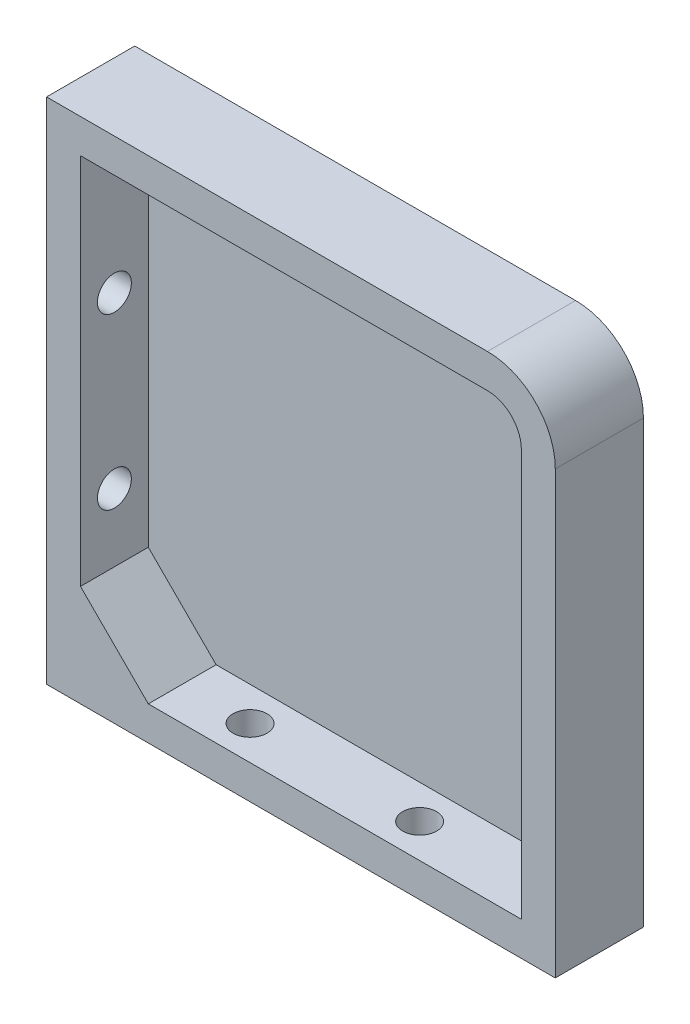
ISO-10303-21;
HEADER;
FILE_DESCRIPTION(('STEP AP214'),'2;1');
FILE_NAME('part.step','',(''),(''),'','','');
FILE_SCHEMA(('AUTOMOTIVE_DESIGN { 1 0 10303 214 1 1 1 1 }'));
ENDSEC;
DATA;
#1=APPLICATION_CONTEXT('core data for automotive mechanical design processes');
#2=APPLICATION_PROTOCOL_DEFINITION('international standard','automotive_design',2000,#1);
#3=PRODUCT_CONTEXT('',#1,'mechanical');
#4=PRODUCT('Part','Part','',(#3));
#5=PRODUCT_RELATED_PRODUCT_CATEGORY('part','',(#4));
#6=PRODUCT_DEFINITION_FORMATION('','',#4);
#7=PRODUCT_DEFINITION_CONTEXT('part definition',#1,'design');
#8=PRODUCT_DEFINITION('design','',#6,#7);
#9=PRODUCT_DEFINITION_SHAPE('','',#8);
#10=(LENGTH_UNIT() NAMED_UNIT(*) SI_UNIT(.MILLI.,.METRE.));
#11=(NAMED_UNIT(*) PLANE_ANGLE_UNIT() SI_UNIT($,.RADIAN.));
#12=(NAMED_UNIT(*) SI_UNIT($,.STERADIAN.) SOLID_ANGLE_UNIT());
#13=UNCERTAINTY_MEASURE_WITH_UNIT(LENGTH_MEASURE(1.E-05),#10,'distance_accuracy_value','');
#14=(GEOMETRIC_REPRESENTATION_CONTEXT(3) GLOBAL_UNCERTAINTY_ASSIGNED_CONTEXT((#13)) GLOBAL_UNIT_ASSIGNED_CONTEXT((#10,
#11,#12)) REPRESENTATION_CONTEXT('',''));
#15=CARTESIAN_POINT('',(0.,0.,0.));
#16=DIRECTION('',(0.,0.,1.));
#17=DIRECTION('',(1.,0.,0.));
#18=AXIS2_PLACEMENT_3D('',#15,#16,#17);
#19=CARTESIAN_POINT('',(-15.8815636921236,33.7284482758621,13.));
#20=DIRECTION('',(1.,0.,0.));
#21=DIRECTION('',(0.,1.,0.));
#22=AXIS2_PLACEMENT_3D('',#19,#20,#21);
#23=PLANE('',#22);
#24=CARTESIAN_POINT('',(-15.8815636921236,8.72844827586207,8.));
#25=DIRECTION('',(1.,0.,0.));
#26=DIRECTION('',(0.,1.,0.));
#27=AXIS2_PLACEMENT_3D('',#24,#25,#26);
#28=CIRCLE('',#27,2.5);
#29=CARTESIAN_POINT('',(-15.8815636921236,11.2284482758621,8.));
#30=VERTEX_POINT('',#29);
#31=EDGE_CURVE('E151',#30,#30,#28,.F.);
#32=ORIENTED_EDGE('',*,*,#31,.T.);
#33=EDGE_LOOP('',(#32));
#34=FACE_BOUND('',#33,.T.);
#35=CARTESIAN_POINT('',(-15.8815636921236,-16.2715517241379,8.));
#36=DIRECTION('',(1.,0.,0.));
#37=DIRECTION('',(0.,1.,0.));
#38=AXIS2_PLACEMENT_3D('',#35,#36,#37);
#39=CIRCLE('',#38,2.5);
#40=CARTESIAN_POINT('',(-15.8815636921236,-13.7715517241379,8.));
#41=VERTEX_POINT('',#40);
#42=EDGE_CURVE('E126',#41,#41,#39,.F.);
#43=ORIENTED_EDGE('',*,*,#42,.T.);
#44=EDGE_LOOP('',(#43));
#45=FACE_BOUND('',#44,.T.);
#46=DIRECTION('',(0.,-1.,0.));
#47=VECTOR('',#46,1.);
#48=CARTESIAN_POINT('',(-15.8815636921236,23.7284482758621,13.));
#49=LINE('',#48,#47);
#50=CARTESIAN_POINT('',(-15.8815636921236,28.7284482758621,13.));
#51=VERTEX_POINT('',#50);
#52=CARTESIAN_POINT('',(-15.8815636921236,-26.2715517241379,13.));
#53=VERTEX_POINT('',#52);
#54=EDGE_CURVE('E48',#51,#53,#49,.T.);
#55=ORIENTED_EDGE('',*,*,#54,.T.);
#56=DIRECTION('',(0.,0.,-1.));
#57=VECTOR('',#56,1.);
#58=CARTESIAN_POINT('',(-15.8815636921236,-26.2715517241379,27.142135623731));
#59=LINE('',#58,#57);
#60=CARTESIAN_POINT('',(-15.8815636921236,-26.2715517241379,3.));
#61=VERTEX_POINT('',#60);
#62=EDGE_CURVE('E129',#53,#61,#59,.T.);
#63=ORIENTED_EDGE('',*,*,#62,.T.);
#64=DIRECTION('',(0.,-1.,0.));
#65=VECTOR('',#64,1.);
#66=CARTESIAN_POINT('',(-15.8815636921236,23.7284482758621,3.));
#67=LINE('',#66,#65);
#68=CARTESIAN_POINT('',(-15.8815636921236,28.7284482758621,3.));
#69=VERTEX_POINT('',#68);
#70=EDGE_CURVE('E118',#69,#61,#67,.T.);
#71=ORIENTED_EDGE('',*,*,#70,.F.);
#72=DIRECTION('',(0.,0.,-1.));
#73=VECTOR('',#72,1.);
#74=CARTESIAN_POINT('',(-15.8815636921236,28.7284482758621,13.));
#75=LINE('',#74,#73);
#76=EDGE_CURVE('E162',#51,#69,#75,.T.);
#77=ORIENTED_EDGE('',*,*,#76,.F.);
#78=EDGE_LOOP('',(#55,#63,#71,#77));
#79=FACE_BOUND('',#78,.T.);
#80=ADVANCED_FACE('F33',(#34,#45,#79),#23,.T.);
#81=CARTESIAN_POINT('',(-20.8815636921236,-36.2715517241379,13.));
#82=DIRECTION('',(0.,1.,0.));
#83=DIRECTION('',(0.,0.,1.));
#84=AXIS2_PLACEMENT_3D('',#81,#82,#83);
#85=PLANE('',#84);
#86=CARTESIAN_POINT('',(29.1184363078764,-36.2715517241379,8.));
#87=DIRECTION('',(0.,1.,0.));
#88=DIRECTION('',(0.,0.,1.));
#89=AXIS2_PLACEMENT_3D('',#86,#87,#88);
#90=CIRCLE('',#89,2.5);
#91=CARTESIAN_POINT('',(29.1184363078764,-36.2715517241379,5.5));
#92=VERTEX_POINT('',#91);
#93=EDGE_CURVE('E142',#92,#92,#90,.F.);
#94=ORIENTED_EDGE('',*,*,#93,.T.);
#95=EDGE_LOOP('',(#94));
#96=FACE_BOUND('',#95,.T.);
#97=CARTESIAN_POINT('',(4.11843630787644,-36.2715517241379,8.));
#98=DIRECTION('',(0.,1.,0.));
#99=DIRECTION('',(0.,0.,1.));
#100=AXIS2_PLACEMENT_3D('',#97,#98,#99);
#101=CIRCLE('',#100,2.5);
#102=CARTESIAN_POINT('',(4.11843630787644,-36.2715517241379,5.5));
#103=VERTEX_POINT('',#102);
#104=EDGE_CURVE('E148',#103,#103,#101,.F.);
#105=ORIENTED_EDGE('',*,*,#104,.T.);
#106=EDGE_LOOP('',(#105));
#107=FACE_BOUND('',#106,.T.);
#108=DIRECTION('',(1.,0.,0.));
#109=VECTOR('',#108,1.);
#110=CARTESIAN_POINT('',(44.1184363078764,-36.2715517241379,3.));
#111=LINE('',#110,#109);
#112=CARTESIAN_POINT('',(-5.88156369212357,-36.2715517241379,3.));
#113=VERTEX_POINT('',#112);
#114=CARTESIAN_POINT('',(49.1184363078764,-36.2715517241379,3.));
#115=VERTEX_POINT('',#114);
#116=EDGE_CURVE('E125',#113,#115,#111,.T.);
#117=ORIENTED_EDGE('',*,*,#116,.F.);
#118=DIRECTION('',(0.,0.,-1.));
#119=VECTOR('',#118,1.);
#120=CARTESIAN_POINT('',(-5.88156369212357,-36.2715517241379,27.142135623731));
#121=LINE('',#120,#119);
#122=CARTESIAN_POINT('',(-5.88156369212357,-36.2715517241379,13.));
#123=VERTEX_POINT('',#122);
#124=EDGE_CURVE('E56',#123,#113,#121,.T.);
#125=ORIENTED_EDGE('',*,*,#124,.F.);
#126=DIRECTION('',(1.,0.,0.));
#127=VECTOR('',#126,1.);
#128=CARTESIAN_POINT('',(44.1184363078764,-36.2715517241379,13.));
#129=LINE('',#128,#127);
#130=CARTESIAN_POINT('',(49.1184363078764,-36.2715517241379,13.));
#131=VERTEX_POINT('',#130);
#132=EDGE_CURVE('E182',#123,#131,#129,.T.);
#133=ORIENTED_EDGE('',*,*,#132,.T.);
#134=DIRECTION('',(0.,0.,-1.));
#135=VECTOR('',#134,1.);
#136=CARTESIAN_POINT('',(49.1184363078764,-36.2715517241379,13.));
#137=LINE('',#136,#135);
#138=EDGE_CURVE('E168',#131,#115,#137,.T.);
#139=ORIENTED_EDGE('',*,*,#138,.T.);
#140=EDGE_LOOP('',(#117,#125,#133,#139));
#141=FACE_BOUND('',#140,.T.);
#142=ADVANCED_FACE('F258',(#96,#107,#141),#85,.T.);
#143=CARTESIAN_POINT('',(44.1184363078764,23.7284482758621,3.));
#144=DIRECTION('',(0.,0.,-1.));
#145=DIRECTION('',(-1.,0.,0.));
#146=AXIS2_PLACEMENT_3D('',#143,#144,#145);
#147=PLANE('',#146);
#148=DIRECTION('',(-0.707106781186547,0.707106781186548,0.));
#149=VECTOR('',#148,1.);
#150=CARTESIAN_POINT('',(-15.8815636921236,-26.2715517241379,3.));
#151=LINE('',#150,#149);
#152=EDGE_CURVE('E121',#113,#61,#151,.T.);
#153=ORIENTED_EDGE('',*,*,#152,.F.);
#154=ORIENTED_EDGE('',*,*,#116,.T.);
#155=DIRECTION('',(0.,1.,0.));
#156=VECTOR('',#155,1.);
#157=CARTESIAN_POINT('',(49.1184363078764,23.7284482758621,3.));
#158=LINE('',#157,#156);
#159=CARTESIAN_POINT('',(49.1184363078764,23.728448275862,3.));
#160=VERTEX_POINT('',#159);
#161=EDGE_CURVE('E167',#115,#160,#158,.T.);
#162=ORIENTED_EDGE('',*,*,#161,.T.);
#163=CARTESIAN_POINT('',(44.1184363078764,23.7284482758621,3.));
#164=DIRECTION('',(0.,0.,-1.));
#165=DIRECTION('',(-1.,0.,0.));
#166=AXIS2_PLACEMENT_3D('',#163,#164,#165);
#167=CIRCLE('',#166,5.);
#168=CARTESIAN_POINT('',(44.1184363078763,28.7284482758621,3.));
#169=VERTEX_POINT('',#168);
#170=EDGE_CURVE('E174',#160,#169,#167,.F.);
#171=ORIENTED_EDGE('',*,*,#170,.T.);
#172=DIRECTION('',(-1.,0.,0.));
#173=VECTOR('',#172,1.);
#174=CARTESIAN_POINT('',(44.1184363078764,28.7284482758621,3.));
#175=LINE('',#174,#173);
#176=EDGE_CURVE('E123',#169,#69,#175,.T.);
#177=ORIENTED_EDGE('',*,*,#176,.T.);
#178=ORIENTED_EDGE('',*,*,#70,.T.);
#179=EDGE_LOOP('',(#153,#154,#162,#171,#177,#178));
#180=FACE_BOUND('',#179,.T.);
#181=ADVANCED_FACE('F119',(#180),#147,.F.);
#182=CARTESIAN_POINT('',(44.1184363078764,23.7284482758621,13.));
#183=DIRECTION('',(0.,0.,-1.));
#184=DIRECTION('',(-1.,0.,0.));
#185=AXIS2_PLACEMENT_3D('',#182,#183,#184);
#186=PLANE('',#185);
#187=DIRECTION('',(0.707106781186547,-0.707106781186548,0.));
#188=VECTOR('',#187,1.);
#189=CARTESIAN_POINT('',(-15.8815636921236,-26.2715517241379,13.));
#190=LINE('',#189,#188);
#191=EDGE_CURVE('E137',#53,#123,#190,.T.);
#192=ORIENTED_EDGE('',*,*,#191,.F.);
#193=ORIENTED_EDGE('',*,*,#54,.F.);
#194=DIRECTION('',(-1.,0.,0.));
#195=VECTOR('',#194,1.);
#196=CARTESIAN_POINT('',(44.1184363078764,28.7284482758621,13.));
#197=LINE('',#196,#195);
#198=CARTESIAN_POINT('',(44.1184363078764,28.7284482758621,13.));
#199=VERTEX_POINT('',#198);
#200=EDGE_CURVE('E165',#199,#51,#197,.T.);
#201=ORIENTED_EDGE('',*,*,#200,.F.);
#202=CARTESIAN_POINT('',(44.1184363078764,23.7284482758621,13.));
#203=DIRECTION('',(0.,0.,-1.));
#204=DIRECTION('',(-1.,0.,0.));
#205=AXIS2_PLACEMENT_3D('',#202,#203,#204);
#206=CIRCLE('',#205,5.);
#207=CARTESIAN_POINT('',(49.1184363078764,23.728448275862,13.));
#208=VERTEX_POINT('',#207);
#209=EDGE_CURVE('E186',#208,#199,#206,.F.);
#210=ORIENTED_EDGE('',*,*,#209,.F.);
#211=DIRECTION('',(0.,1.,0.));
#212=VECTOR('',#211,1.);
#213=CARTESIAN_POINT('',(49.1184363078764,23.7284482758621,13.));
#214=LINE('',#213,#212);
#215=EDGE_CURVE('E184',#131,#208,#214,.T.);
#216=ORIENTED_EDGE('',*,*,#215,.F.);
#217=ORIENTED_EDGE('',*,*,#132,.F.);
#218=EDGE_LOOP('',(#192,#193,#201,#210,#216,#217));
#219=FACE_BOUND('',#218,.T.);
#220=DIRECTION('',(0.,-1.,0.));
#221=VECTOR('',#220,1.);
#222=CARTESIAN_POINT('',(-20.8815636921236,33.7284482758621,13.));
#223=LINE('',#222,#221);
#224=CARTESIAN_POINT('',(-20.8815636921236,33.7284482758621,13.));
#225=VERTEX_POINT('',#224);
#226=CARTESIAN_POINT('',(-20.8815636921236,-41.2715517241379,13.));
#227=VERTEX_POINT('',#226);
#228=EDGE_CURVE('E190',#225,#227,#223,.T.);
#229=ORIENTED_EDGE('',*,*,#228,.T.);
#230=DIRECTION('',(1.,0.,0.));
#231=VECTOR('',#230,1.);
#232=CARTESIAN_POINT('',(-20.8815636921236,-41.2715517241379,13.));
#233=LINE('',#232,#231);
#234=CARTESIAN_POINT('',(54.1184363078764,-41.2715517241379,13.));
#235=VERTEX_POINT('',#234);
#236=EDGE_CURVE('E193',#227,#235,#233,.T.);
#237=ORIENTED_EDGE('',*,*,#236,.T.);
#238=DIRECTION('',(0.,1.,0.));
#239=VECTOR('',#238,1.);
#240=CARTESIAN_POINT('',(54.1184363078764,23.728448275862,13.));
#241=LINE('',#240,#239);
#242=CARTESIAN_POINT('',(54.1184363078764,23.728448275862,13.));
#243=VERTEX_POINT('',#242);
#244=EDGE_CURVE('E196',#235,#243,#241,.T.);
#245=ORIENTED_EDGE('',*,*,#244,.T.);
#246=CARTESIAN_POINT('',(44.1184363078764,23.7284482758621,13.));
#247=DIRECTION('',(0.,0.,1.));
#248=DIRECTION('',(-1.,0.,0.));
#249=AXIS2_PLACEMENT_3D('',#246,#247,#248);
#250=CIRCLE('',#249,10.);
#251=CARTESIAN_POINT('',(44.1184363078764,33.7284482758621,13.));
#252=VERTEX_POINT('',#251);
#253=EDGE_CURVE('E198',#243,#252,#250,.T.);
#254=ORIENTED_EDGE('',*,*,#253,.T.);
#255=DIRECTION('',(-1.,0.,0.));
#256=VECTOR('',#255,1.);
#257=CARTESIAN_POINT('',(-20.8815636921236,33.7284482758621,13.));
#258=LINE('',#257,#256);
#259=EDGE_CURVE('E200',#252,#225,#258,.T.);
#260=ORIENTED_EDGE('',*,*,#259,.T.);
#261=EDGE_LOOP('',(#229,#237,#245,#254,#260));
#262=FACE_BOUND('',#261,.T.);
#263=ADVANCED_FACE('F242',(#219,#262),#186,.F.);
#264=CARTESIAN_POINT('',(-20.8815636921236,33.7284482758621,13.));
#265=DIRECTION('',(1.,0.,0.));
#266=DIRECTION('',(0.,1.,0.));
#267=AXIS2_PLACEMENT_3D('',#264,#265,#266);
#268=PLANE('',#267);
#269=CARTESIAN_POINT('',(-20.8815636921236,8.72844827586207,8.));
#270=DIRECTION('',(-1.,0.,0.));
#271=DIRECTION('',(0.,-1.,0.));
#272=AXIS2_PLACEMENT_3D('',#269,#270,#271);
#273=CIRCLE('',#272,2.5);
#274=CARTESIAN_POINT('',(-20.8815636921236,6.22844827586207,8.));
#275=VERTEX_POINT('',#274);
#276=EDGE_CURVE('E154',#275,#275,#273,.T.);
#277=ORIENTED_EDGE('',*,*,#276,.F.);
#278=EDGE_LOOP('',(#277));
#279=FACE_BOUND('',#278,.T.);
#280=CARTESIAN_POINT('',(-20.8815636921236,-16.2715517241379,8.));
#281=DIRECTION('',(-1.,0.,0.));
#282=DIRECTION('',(0.,-1.,0.));
#283=AXIS2_PLACEMENT_3D('',#280,#281,#282);
#284=CIRCLE('',#283,2.5);
#285=CARTESIAN_POINT('',(-20.8815636921236,-18.7715517241379,8.));
#286=VERTEX_POINT('',#285);
#287=EDGE_CURVE('E157',#286,#286,#284,.T.);
#288=ORIENTED_EDGE('',*,*,#287,.F.);
#289=EDGE_LOOP('',(#288));
#290=FACE_BOUND('',#289,.T.);
#291=DIRECTION('',(0.,-1.,0.));
#292=VECTOR('',#291,1.);
#293=CARTESIAN_POINT('',(-20.8815636921236,33.7284482758621,0.));
#294=LINE('',#293,#292);
#295=CARTESIAN_POINT('',(-20.8815636921236,33.7284482758621,0.));
#296=VERTEX_POINT('',#295);
#297=CARTESIAN_POINT('',(-20.8815636921236,-41.2715517241379,0.));
#298=VERTEX_POINT('',#297);
#299=EDGE_CURVE('E171',#296,#298,#294,.T.);
#300=ORIENTED_EDGE('',*,*,#299,.T.);
#301=DIRECTION('',(0.,0.,-1.));
#302=VECTOR('',#301,1.);
#303=CARTESIAN_POINT('',(-20.8815636921236,-41.2715517241379,13.));
#304=LINE('',#303,#302);
#305=EDGE_CURVE('E11',#227,#298,#304,.T.);
#306=ORIENTED_EDGE('',*,*,#305,.F.);
#307=ORIENTED_EDGE('',*,*,#228,.F.);
#308=DIRECTION('',(0.,0.,-1.));
#309=VECTOR('',#308,1.);
#310=CARTESIAN_POINT('',(-20.8815636921236,33.7284482758621,13.));
#311=LINE('',#310,#309);
#312=EDGE_CURVE('E202',#225,#296,#311,.T.);
#313=ORIENTED_EDGE('',*,*,#312,.T.);
#314=EDGE_LOOP('',(#300,#306,#307,#313));
#315=FACE_BOUND('',#314,.T.);
#316=ADVANCED_FACE('F35',(#279,#290,#315),#268,.F.);
#317=CARTESIAN_POINT('',(-20.8815636921236,-41.2715517241379,13.));
#318=DIRECTION('',(0.,1.,0.));
#319=DIRECTION('',(0.,0.,1.));
#320=AXIS2_PLACEMENT_3D('',#317,#318,#319);
#321=PLANE('',#320);
#322=CARTESIAN_POINT('',(29.1184363078764,-41.2715517241379,8.));
#323=DIRECTION('',(0.,-1.,0.));
#324=DIRECTION('',(0.,0.,-1.));
#325=AXIS2_PLACEMENT_3D('',#322,#323,#324);
#326=CIRCLE('',#325,2.5);
#327=CARTESIAN_POINT('',(29.1184363078764,-41.2715517241379,5.5));
#328=VERTEX_POINT('',#327);
#329=EDGE_CURVE('E139',#328,#328,#326,.T.);
#330=ORIENTED_EDGE('',*,*,#329,.F.);
#331=EDGE_LOOP('',(#330));
#332=FACE_BOUND('',#331,.T.);
#333=CARTESIAN_POINT('',(4.11843630787644,-41.2715517241379,8.));
#334=DIRECTION('',(0.,-1.,0.));
#335=DIRECTION('',(0.,0.,-1.));
#336=AXIS2_PLACEMENT_3D('',#333,#334,#335);
#337=CIRCLE('',#336,2.5);
#338=CARTESIAN_POINT('',(4.11843630787644,-41.2715517241379,5.5));
#339=VERTEX_POINT('',#338);
#340=EDGE_CURVE('E145',#339,#339,#337,.T.);
#341=ORIENTED_EDGE('',*,*,#340,.F.);
#342=EDGE_LOOP('',(#341));
#343=FACE_BOUND('',#342,.T.);
#344=DIRECTION('',(1.,0.,0.));
#345=VECTOR('',#344,1.);
#346=CARTESIAN_POINT('',(-20.8815636921236,-41.2715517241379,0.));
#347=LINE('',#346,#345);
#348=CARTESIAN_POINT('',(54.1184363078764,-41.2715517241379,0.));
#349=VERTEX_POINT('',#348);
#350=EDGE_CURVE('E205',#298,#349,#347,.T.);
#351=ORIENTED_EDGE('',*,*,#350,.T.);
#352=DIRECTION('',(0.,0.,-1.));
#353=VECTOR('',#352,1.);
#354=CARTESIAN_POINT('',(54.1184363078764,-41.2715517241379,13.));
#355=LINE('',#354,#353);
#356=EDGE_CURVE('E41',#235,#349,#355,.T.);
#357=ORIENTED_EDGE('',*,*,#356,.F.);
#358=ORIENTED_EDGE('',*,*,#236,.F.);
#359=ORIENTED_EDGE('',*,*,#305,.T.);
#360=EDGE_LOOP('',(#351,#357,#358,#359));
#361=FACE_BOUND('',#360,.T.);
#362=ADVANCED_FACE('F244',(#332,#343,#361),#321,.F.);
#363=CARTESIAN_POINT('',(54.1184363078764,23.728448275862,13.));
#364=DIRECTION('',(-1.,0.,0.));
#365=DIRECTION('',(0.,0.,1.));
#366=AXIS2_PLACEMENT_3D('',#363,#364,#365);
#367=PLANE('',#366);
#368=DIRECTION('',(0.,1.,0.));
#369=VECTOR('',#368,1.);
#370=CARTESIAN_POINT('',(54.1184363078764,23.728448275862,0.));
#371=LINE('',#370,#369);
#372=CARTESIAN_POINT('',(54.1184363078764,23.728448275862,0.));
#373=VERTEX_POINT('',#372);
#374=EDGE_CURVE('E207',#349,#373,#371,.T.);
#375=ORIENTED_EDGE('',*,*,#374,.T.);
#376=DIRECTION('',(0.,0.,-1.));
#377=VECTOR('',#376,1.);
#378=CARTESIAN_POINT('',(54.1184363078764,23.728448275862,13.));
#379=LINE('',#378,#377);
#380=EDGE_CURVE('E217',#243,#373,#379,.T.);
#381=ORIENTED_EDGE('',*,*,#380,.F.);
#382=ORIENTED_EDGE('',*,*,#244,.F.);
#383=ORIENTED_EDGE('',*,*,#356,.T.);
#384=EDGE_LOOP('',(#375,#381,#382,#383));
#385=FACE_BOUND('',#384,.T.);
#386=ADVANCED_FACE('F224',(#385),#367,.F.);
#387=CARTESIAN_POINT('',(44.1184363078764,23.7284482758621,13.));
#388=DIRECTION('',(0.,0.,-1.));
#389=DIRECTION('',(-1.,0.,0.));
#390=AXIS2_PLACEMENT_3D('',#387,#388,#389);
#391=CYLINDRICAL_SURFACE('',#390,10.);
#392=CARTESIAN_POINT('',(44.1184363078764,23.7284482758621,0.));
#393=DIRECTION('',(0.,0.,1.));
#394=DIRECTION('',(-1.,0.,0.));
#395=AXIS2_PLACEMENT_3D('',#392,#393,#394);
#396=CIRCLE('',#395,10.);
#397=CARTESIAN_POINT('',(44.1184363078764,33.7284482758621,0.));
#398=VERTEX_POINT('',#397);
#399=EDGE_CURVE('E209',#373,#398,#396,.T.);
#400=ORIENTED_EDGE('',*,*,#399,.T.);
#401=DIRECTION('',(0.,0.,-1.));
#402=VECTOR('',#401,1.);
#403=CARTESIAN_POINT('',(44.1184363078764,33.7284482758621,13.));
#404=LINE('',#403,#402);
#405=EDGE_CURVE('E214',#252,#398,#404,.T.);
#406=ORIENTED_EDGE('',*,*,#405,.F.);
#407=ORIENTED_EDGE('',*,*,#253,.F.);
#408=ORIENTED_EDGE('',*,*,#380,.T.);
#409=EDGE_LOOP('',(#400,#406,#407,#408));
#410=FACE_BOUND('',#409,.T.);
#411=ADVANCED_FACE('F234',(#410),#391,.T.);
#412=CARTESIAN_POINT('',(-20.8815636921236,33.7284482758621,13.));
#413=DIRECTION('',(0.,-1.,0.));
#414=DIRECTION('',(0.,0.,-1.));
#415=AXIS2_PLACEMENT_3D('',#412,#413,#414);
#416=PLANE('',#415);
#417=DIRECTION('',(-1.,0.,0.));
#418=VECTOR('',#417,1.);
#419=CARTESIAN_POINT('',(-20.8815636921236,33.7284482758621,0.));
#420=LINE('',#419,#418);
#421=EDGE_CURVE('E194',#398,#296,#420,.T.);
#422=ORIENTED_EDGE('',*,*,#421,.T.);
#423=ORIENTED_EDGE('',*,*,#312,.F.);
#424=ORIENTED_EDGE('',*,*,#259,.F.);
#425=ORIENTED_EDGE('',*,*,#405,.T.);
#426=EDGE_LOOP('',(#422,#423,#424,#425));
#427=FACE_BOUND('',#426,.T.);
#428=ADVANCED_FACE('F238',(#427),#416,.F.);
#429=CARTESIAN_POINT('',(44.1184363078764,23.7284482758621,0.));
#430=DIRECTION('',(0.,0.,-1.));
#431=DIRECTION('',(-1.,0.,0.));
#432=AXIS2_PLACEMENT_3D('',#429,#430,#431);
#433=PLANE('',#432);
#434=ORIENTED_EDGE('',*,*,#299,.F.);
#435=ORIENTED_EDGE('',*,*,#421,.F.);
#436=ORIENTED_EDGE('',*,*,#399,.F.);
#437=ORIENTED_EDGE('',*,*,#374,.F.);
#438=ORIENTED_EDGE('',*,*,#350,.F.);
#439=EDGE_LOOP('',(#434,#435,#436,#437,#438));
#440=FACE_BOUND('',#439,.T.);
#441=ADVANCED_FACE('F230',(#440),#433,.T.);
#442=CARTESIAN_POINT('',(49.1184363078764,23.728448275862,13.));
#443=DIRECTION('',(-1.,0.,0.));
#444=DIRECTION('',(0.,0.,1.));
#445=AXIS2_PLACEMENT_3D('',#442,#443,#444);
#446=PLANE('',#445);
#447=ORIENTED_EDGE('',*,*,#161,.F.);
#448=ORIENTED_EDGE('',*,*,#138,.F.);
#449=ORIENTED_EDGE('',*,*,#215,.T.);
#450=DIRECTION('',(0.,0.,-1.));
#451=VECTOR('',#450,1.);
#452=CARTESIAN_POINT('',(49.1184363078764,23.728448275862,13.));
#453=LINE('',#452,#451);
#454=EDGE_CURVE('E172',#208,#160,#453,.T.);
#455=ORIENTED_EDGE('',*,*,#454,.T.);
#456=EDGE_LOOP('',(#447,#448,#449,#455));
#457=FACE_BOUND('',#456,.T.);
#458=ADVANCED_FACE('F271',(#457),#446,.T.);
#459=CARTESIAN_POINT('',(44.1184363078764,23.7284482758621,13.));
#460=DIRECTION('',(0.,0.,-1.));
#461=DIRECTION('',(-1.,0.,0.));
#462=AXIS2_PLACEMENT_3D('',#459,#460,#461);
#463=CYLINDRICAL_SURFACE('',#462,5.);
#464=ORIENTED_EDGE('',*,*,#170,.F.);
#465=ORIENTED_EDGE('',*,*,#454,.F.);
#466=ORIENTED_EDGE('',*,*,#209,.T.);
#467=DIRECTION('',(0.,0.,-1.));
#468=VECTOR('',#467,1.);
#469=CARTESIAN_POINT('',(44.1184363078763,28.7284482758621,13.));
#470=LINE('',#469,#468);
#471=EDGE_CURVE('E164',#199,#169,#470,.T.);
#472=ORIENTED_EDGE('',*,*,#471,.T.);
#473=EDGE_LOOP('',(#464,#465,#466,#472));
#474=FACE_BOUND('',#473,.T.);
#475=ADVANCED_FACE('F274',(#474),#463,.F.);
#476=CARTESIAN_POINT('',(-20.8815636921236,28.7284482758621,13.));
#477=DIRECTION('',(0.,-1.,0.));
#478=DIRECTION('',(0.,0.,-1.));
#479=AXIS2_PLACEMENT_3D('',#476,#477,#478);
#480=PLANE('',#479);
#481=ORIENTED_EDGE('',*,*,#176,.F.);
#482=ORIENTED_EDGE('',*,*,#471,.F.);
#483=ORIENTED_EDGE('',*,*,#200,.T.);
#484=ORIENTED_EDGE('',*,*,#76,.T.);
#485=EDGE_LOOP('',(#481,#482,#483,#484));
#486=FACE_BOUND('',#485,.T.);
#487=ADVANCED_FACE('F278',(#486),#480,.T.);
#488=CARTESIAN_POINT('',(-8.81049588025809,-16.2715517241379,8.));
#489=DIRECTION('',(-1.,0.,0.));
#490=DIRECTION('',(0.,-1.,0.));
#491=AXIS2_PLACEMENT_3D('',#488,#489,#490);
#492=CYLINDRICAL_SURFACE('',#491,2.5);
#493=ORIENTED_EDGE('',*,*,#287,.T.);
#494=EDGE_LOOP('',(#493));
#495=FACE_BOUND('',#494,.T.);
#496=ORIENTED_EDGE('',*,*,#42,.F.);
#497=EDGE_LOOP('',(#496));
#498=FACE_BOUND('',#497,.T.);
#499=ADVANCED_FACE('F268',(#495,#498),#492,.F.);
#500=CARTESIAN_POINT('',(-8.81049588025809,8.72844827586207,8.));
#501=DIRECTION('',(-1.,0.,0.));
#502=DIRECTION('',(0.,-1.,0.));
#503=AXIS2_PLACEMENT_3D('',#500,#501,#502);
#504=CYLINDRICAL_SURFACE('',#503,2.5);
#505=ORIENTED_EDGE('',*,*,#276,.T.);
#506=EDGE_LOOP('',(#505));
#507=FACE_BOUND('',#506,.T.);
#508=ORIENTED_EDGE('',*,*,#31,.F.);
#509=EDGE_LOOP('',(#508));
#510=FACE_BOUND('',#509,.T.);
#511=ADVANCED_FACE('F326',(#507,#510),#504,.F.);
#512=CARTESIAN_POINT('',(4.11843630787644,-29.2004839122724,8.));
#513=DIRECTION('',(0.,-1.,0.));
#514=DIRECTION('',(0.,0.,-1.));
#515=AXIS2_PLACEMENT_3D('',#512,#513,#514);
#516=CYLINDRICAL_SURFACE('',#515,2.5);
#517=CARTESIAN_POINT('',(4.11843630787644,-41.2715517241379,5.5));
#518=CARTESIAN_POINT('',(4.11843630787644,-41.2194683908046,5.5));
#519=CARTESIAN_POINT('',(4.11843630787644,-41.1673850574713,5.5));
#520=CARTESIAN_POINT('',(4.11843630787644,-41.0632183908046,5.5));
#521=CARTESIAN_POINT('',(4.11843630787644,-41.0111350574713,5.5));
#522=CARTESIAN_POINT('',(4.11843630787644,-40.9069683908046,5.5));
#523=CARTESIAN_POINT('',(4.11843630787644,-40.8548850574713,5.5));
#524=CARTESIAN_POINT('',(4.11843630787644,-40.7507183908046,5.5));
#525=CARTESIAN_POINT('',(4.11843630787644,-40.6986350574713,5.5));
#526=CARTESIAN_POINT('',(4.11843630787644,-40.5944683908046,5.5));
#527=CARTESIAN_POINT('',(4.11843630787644,-40.5423850574713,5.5));
#528=CARTESIAN_POINT('',(4.11843630787644,-40.4382183908046,5.5));
#529=CARTESIAN_POINT('',(4.11843630787644,-40.3861350574713,5.5));
#530=CARTESIAN_POINT('',(4.11843630787644,-40.2819683908046,5.5));
#531=CARTESIAN_POINT('',(4.11843630787644,-40.2298850574713,5.5));
#532=CARTESIAN_POINT('',(4.11843630787644,-40.1257183908046,5.5));
#533=CARTESIAN_POINT('',(4.11843630787644,-40.0736350574713,5.5));
#534=CARTESIAN_POINT('',(4.11843630787644,-39.9694683908046,5.5));
#535=CARTESIAN_POINT('',(4.11843630787644,-39.9173850574713,5.5));
#536=CARTESIAN_POINT('',(4.11843630787644,-39.8132183908046,5.5));
#537=CARTESIAN_POINT('',(4.11843630787644,-39.7611350574713,5.5));
#538=CARTESIAN_POINT('',(4.11843630787644,-39.6569683908046,5.5));
#539=CARTESIAN_POINT('',(4.11843630787644,-39.6048850574713,5.5));
#540=CARTESIAN_POINT('',(4.11843630787644,-39.5007183908046,5.5));
#541=CARTESIAN_POINT('',(4.11843630787644,-39.4486350574713,5.5));
#542=CARTESIAN_POINT('',(4.11843630787644,-39.3444683908046,5.5));
#543=CARTESIAN_POINT('',(4.11843630787644,-39.2923850574713,5.5));
#544=CARTESIAN_POINT('',(4.11843630787644,-39.1882183908046,5.5));
#545=CARTESIAN_POINT('',(4.11843630787644,-39.1361350574713,5.5));
#546=CARTESIAN_POINT('',(4.11843630787644,-39.0319683908046,5.5));
#547=CARTESIAN_POINT('',(4.11843630787644,-38.9798850574713,5.5));
#548=CARTESIAN_POINT('',(4.11843630787644,-38.8757183908046,5.5));
#549=CARTESIAN_POINT('',(4.11843630787644,-38.8236350574713,5.5));
#550=CARTESIAN_POINT('',(4.11843630787644,-38.7194683908046,5.5));
#551=CARTESIAN_POINT('',(4.11843630787644,-38.6673850574713,5.5));
#552=CARTESIAN_POINT('',(4.11843630787644,-38.5632183908046,5.5));
#553=CARTESIAN_POINT('',(4.11843630787644,-38.5111350574713,5.5));
#554=CARTESIAN_POINT('',(4.11843630787644,-38.4069683908046,5.5));
#555=CARTESIAN_POINT('',(4.11843630787644,-38.3548850574713,5.5));
#556=CARTESIAN_POINT('',(4.11843630787644,-38.2507183908046,5.5));
#557=CARTESIAN_POINT('',(4.11843630787644,-38.1986350574713,5.5));
#558=CARTESIAN_POINT('',(4.11843630787644,-38.0944683908046,5.5));
#559=CARTESIAN_POINT('',(4.11843630787644,-38.0423850574713,5.5));
#560=CARTESIAN_POINT('',(4.11843630787644,-37.9382183908046,5.5));
#561=CARTESIAN_POINT('',(4.11843630787644,-37.8861350574713,5.5));
#562=CARTESIAN_POINT('',(4.11843630787644,-37.7819683908046,5.5));
#563=CARTESIAN_POINT('',(4.11843630787644,-37.7298850574713,5.5));
#564=CARTESIAN_POINT('',(4.11843630787644,-37.6257183908046,5.5));
#565=CARTESIAN_POINT('',(4.11843630787644,-37.5736350574713,5.5));
#566=CARTESIAN_POINT('',(4.11843630787644,-37.4694683908046,5.5));
#567=CARTESIAN_POINT('',(4.11843630787644,-37.4173850574713,5.5));
#568=CARTESIAN_POINT('',(4.11843630787644,-37.3132183908046,5.5));
#569=CARTESIAN_POINT('',(4.11843630787644,-37.2611350574713,5.5));
#570=CARTESIAN_POINT('',(4.11843630787644,-37.1569683908046,5.5));
#571=CARTESIAN_POINT('',(4.11843630787644,-37.1048850574713,5.5));
#572=CARTESIAN_POINT('',(4.11843630787644,-37.0007183908046,5.5));
#573=CARTESIAN_POINT('',(4.11843630787644,-36.9486350574713,5.5));
#574=CARTESIAN_POINT('',(4.11843630787644,-36.8444683908046,5.5));
#575=CARTESIAN_POINT('',(4.11843630787644,-36.7923850574713,5.5));
#576=CARTESIAN_POINT('',(4.11843630787644,-36.6882183908046,5.5));
#577=CARTESIAN_POINT('',(4.11843630787644,-36.6361350574713,5.5));
#578=CARTESIAN_POINT('',(4.11843630787644,-36.5319683908046,5.5));
#579=CARTESIAN_POINT('',(4.11843630787644,-36.4798850574713,5.5));
#580=CARTESIAN_POINT('',(4.11843630787644,-36.3757183908046,5.5));
#581=CARTESIAN_POINT('',(4.11843630787644,-36.3236350574713,5.5));
#582=CARTESIAN_POINT('',(4.11843630787644,-36.2715517241379,5.5));
#583=B_SPLINE_CURVE_WITH_KNOTS('',3,(#517,#518,#519,#520,#521,#522,#523,#524,#525,#526,#527,
#528,#529,#530,#531,#532,#533,#534,#535,#536,#537,#538,#539,#540,#541,#542,#543,#544,#545,#546,
#547,#548,#549,#550,#551,#552,#553,#554,#555,#556,#557,#558,#559,#560,#561,#562,#563,#564,#565,
#566,#567,#568,#569,#570,#571,#572,#573,#574,#575,#576,#577,#578,#579,#580,#581,#582),
.UNSPECIFIED.,.F.,.F.,(4,2,2,2,2,2,2,2,2,2,2,2,2,2,2,2,2,2,2,2,2,2,2,2,2,2,2,2,2,2,2,2,4),(0.,
0.156250000000004,0.3125,0.468749999999997,0.625000000000001,0.781250000000004,
0.937500000000001,1.09375,1.25,1.40625,1.5625,1.71875,1.87499999999999,2.03125,2.1875,2.34375,
2.5,2.65625,2.8125,2.96875,3.125,3.28125,3.4375,3.59375,3.75,3.90624999999999,4.0625,
4.21874999999999,4.375,4.53124999999999,4.68749999999999,4.84374999999999,4.99999999999999),.UNSPECIFIED.);
#584=EDGE_CURVE('BSEAM333',#339,#103,#583,.T.);
#585=ORIENTED_EDGE('',*,*,#340,.T.);
#586=ORIENTED_EDGE('',*,*,#104,.F.);
#587=ORIENTED_EDGE('',*,*,#584,.T.);
#588=ORIENTED_EDGE('',*,*,#584,.F.);
#589=EDGE_LOOP('',(#585,#587,#586,#588));
#590=FACE_BOUND('',#589,.T.);
#591=ADVANCED_FACE('F333',(#590),#516,.F.);
#592=CARTESIAN_POINT('',(29.1184363078764,-29.2004839122724,8.));
#593=DIRECTION('',(0.,-1.,0.));
#594=DIRECTION('',(0.,0.,-1.));
#595=AXIS2_PLACEMENT_3D('',#592,#593,#594);
#596=CYLINDRICAL_SURFACE('',#595,2.5);
#597=CARTESIAN_POINT('',(29.1184363078764,-41.2715517241379,5.5));
#598=CARTESIAN_POINT('',(29.1184363078764,-41.2194683908046,5.5));
#599=CARTESIAN_POINT('',(29.1184363078764,-41.1673850574713,5.5));
#600=CARTESIAN_POINT('',(29.1184363078764,-41.0632183908046,5.5));
#601=CARTESIAN_POINT('',(29.1184363078764,-41.0111350574713,5.5));
#602=CARTESIAN_POINT('',(29.1184363078764,-40.9069683908046,5.5));
#603=CARTESIAN_POINT('',(29.1184363078764,-40.8548850574713,5.5));
#604=CARTESIAN_POINT('',(29.1184363078764,-40.7507183908046,5.5));
#605=CARTESIAN_POINT('',(29.1184363078764,-40.6986350574713,5.5));
#606=CARTESIAN_POINT('',(29.1184363078764,-40.5944683908046,5.5));
#607=CARTESIAN_POINT('',(29.1184363078764,-40.5423850574713,5.5));
#608=CARTESIAN_POINT('',(29.1184363078764,-40.4382183908046,5.5));
#609=CARTESIAN_POINT('',(29.1184363078764,-40.3861350574713,5.5));
#610=CARTESIAN_POINT('',(29.1184363078764,-40.2819683908046,5.5));
#611=CARTESIAN_POINT('',(29.1184363078764,-40.2298850574713,5.5));
#612=CARTESIAN_POINT('',(29.1184363078764,-40.1257183908046,5.5));
#613=CARTESIAN_POINT('',(29.1184363078764,-40.0736350574713,5.5));
#614=CARTESIAN_POINT('',(29.1184363078764,-39.9694683908046,5.5));
#615=CARTESIAN_POINT('',(29.1184363078764,-39.9173850574713,5.5));
#616=CARTESIAN_POINT('',(29.1184363078764,-39.8132183908046,5.5));
#617=CARTESIAN_POINT('',(29.1184363078764,-39.7611350574713,5.5));
#618=CARTESIAN_POINT('',(29.1184363078764,-39.6569683908046,5.5));
#619=CARTESIAN_POINT('',(29.1184363078764,-39.6048850574713,5.5));
#620=CARTESIAN_POINT('',(29.1184363078764,-39.5007183908046,5.5));
#621=CARTESIAN_POINT('',(29.1184363078764,-39.4486350574713,5.5));
#622=CARTESIAN_POINT('',(29.1184363078764,-39.3444683908046,5.5));
#623=CARTESIAN_POINT('',(29.1184363078764,-39.2923850574713,5.5));
#624=CARTESIAN_POINT('',(29.1184363078764,-39.1882183908046,5.5));
#625=CARTESIAN_POINT('',(29.1184363078764,-39.1361350574713,5.5));
#626=CARTESIAN_POINT('',(29.1184363078764,-39.0319683908046,5.5));
#627=CARTESIAN_POINT('',(29.1184363078764,-38.9798850574713,5.5));
#628=CARTESIAN_POINT('',(29.1184363078764,-38.8757183908046,5.5));
#629=CARTESIAN_POINT('',(29.1184363078764,-38.8236350574713,5.5));
#630=CARTESIAN_POINT('',(29.1184363078764,-38.7194683908046,5.5));
#631=CARTESIAN_POINT('',(29.1184363078764,-38.6673850574713,5.5));
#632=CARTESIAN_POINT('',(29.1184363078764,-38.5632183908046,5.5));
#633=CARTESIAN_POINT('',(29.1184363078764,-38.5111350574713,5.5));
#634=CARTESIAN_POINT('',(29.1184363078764,-38.4069683908046,5.5));
#635=CARTESIAN_POINT('',(29.1184363078764,-38.3548850574713,5.5));
#636=CARTESIAN_POINT('',(29.1184363078764,-38.2507183908046,5.5));
#637=CARTESIAN_POINT('',(29.1184363078764,-38.1986350574713,5.5));
#638=CARTESIAN_POINT('',(29.1184363078764,-38.0944683908046,5.5));
#639=CARTESIAN_POINT('',(29.1184363078764,-38.0423850574713,5.5));
#640=CARTESIAN_POINT('',(29.1184363078764,-37.9382183908046,5.5));
#641=CARTESIAN_POINT('',(29.1184363078764,-37.8861350574713,5.5));
#642=CARTESIAN_POINT('',(29.1184363078764,-37.7819683908046,5.5));
#643=CARTESIAN_POINT('',(29.1184363078764,-37.7298850574713,5.5));
#644=CARTESIAN_POINT('',(29.1184363078764,-37.6257183908046,5.5));
#645=CARTESIAN_POINT('',(29.1184363078764,-37.5736350574713,5.5));
#646=CARTESIAN_POINT('',(29.1184363078764,-37.4694683908046,5.5));
#647=CARTESIAN_POINT('',(29.1184363078764,-37.4173850574713,5.5));
#648=CARTESIAN_POINT('',(29.1184363078764,-37.3132183908046,5.5));
#649=CARTESIAN_POINT('',(29.1184363078764,-37.2611350574713,5.5));
#650=CARTESIAN_POINT('',(29.1184363078764,-37.1569683908046,5.5));
#651=CARTESIAN_POINT('',(29.1184363078764,-37.1048850574713,5.5));
#652=CARTESIAN_POINT('',(29.1184363078764,-37.0007183908046,5.5));
#653=CARTESIAN_POINT('',(29.1184363078764,-36.9486350574713,5.5));
#654=CARTESIAN_POINT('',(29.1184363078764,-36.8444683908046,5.5));
#655=CARTESIAN_POINT('',(29.1184363078764,-36.7923850574713,5.5));
#656=CARTESIAN_POINT('',(29.1184363078764,-36.6882183908046,5.5));
#657=CARTESIAN_POINT('',(29.1184363078764,-36.6361350574713,5.5));
#658=CARTESIAN_POINT('',(29.1184363078764,-36.5319683908046,5.5));
#659=CARTESIAN_POINT('',(29.1184363078764,-36.4798850574713,5.5));
#660=CARTESIAN_POINT('',(29.1184363078764,-36.3757183908046,5.5));
#661=CARTESIAN_POINT('',(29.1184363078764,-36.3236350574713,5.5));
#662=CARTESIAN_POINT('',(29.1184363078764,-36.2715517241379,5.5));
#663=B_SPLINE_CURVE_WITH_KNOTS('',3,(#597,#598,#599,#600,#601,#602,#603,#604,#605,#606,#607,
#608,#609,#610,#611,#612,#613,#614,#615,#616,#617,#618,#619,#620,#621,#622,#623,#624,#625,#626,
#627,#628,#629,#630,#631,#632,#633,#634,#635,#636,#637,#638,#639,#640,#641,#642,#643,#644,#645,
#646,#647,#648,#649,#650,#651,#652,#653,#654,#655,#656,#657,#658,#659,#660,#661,#662),
.UNSPECIFIED.,.F.,.F.,(4,2,2,2,2,2,2,2,2,2,2,2,2,2,2,2,2,2,2,2,2,2,2,2,2,2,2,2,2,2,2,2,4),(0.,
0.156250000000004,0.3125,0.468749999999997,0.625000000000001,0.781250000000004,
0.937500000000001,1.09375,1.25,1.40625,1.5625,1.71875,1.87499999999999,2.03125,2.1875,2.34375,
2.5,2.65625,2.8125,2.96875,3.125,3.28125,3.4375,3.59375,3.75,3.90624999999999,4.0625,
4.21874999999999,4.375,4.53124999999999,4.68749999999999,4.84374999999999,4.99999999999999),.UNSPECIFIED.);
#664=EDGE_CURVE('BSEAM340',#328,#92,#663,.T.);
#665=ORIENTED_EDGE('',*,*,#329,.T.);
#666=ORIENTED_EDGE('',*,*,#93,.F.);
#667=ORIENTED_EDGE('',*,*,#664,.T.);
#668=ORIENTED_EDGE('',*,*,#664,.F.);
#669=EDGE_LOOP('',(#665,#667,#666,#668));
#670=FACE_BOUND('',#669,.T.);
#671=ADVANCED_FACE('F340',(#670),#596,.F.);
#672=CARTESIAN_POINT('',(-15.8815636921236,-26.2715517241379,27.142135623731));
#673=DIRECTION('',(-0.707106781186548,-0.707106781186547,0.));
#674=DIRECTION('',(0.707106781186547,-0.707106781186548,0.));
#675=AXIS2_PLACEMENT_3D('',#672,#673,#674);
#676=PLANE('',#675);
#677=ORIENTED_EDGE('',*,*,#62,.F.);
#678=ORIENTED_EDGE('',*,*,#191,.T.);
#679=ORIENTED_EDGE('',*,*,#124,.T.);
#680=ORIENTED_EDGE('',*,*,#152,.T.);
#681=EDGE_LOOP('',(#677,#678,#679,#680));
#682=FACE_BOUND('',#681,.T.);
#683=ADVANCED_FACE('F133',(#682),#676,.F.);
#684=CLOSED_SHELL('',(#80,#142,#181,#263,#316,#362,#386,#411,#428,#441,#458,#475,#487,#499,#511,
#591,#671,#683));
#685=MANIFOLD_SOLID_BREP('B2',#684);
#686=ADVANCED_BREP_SHAPE_REPRESENTATION('',(#18,#685),#14);
#687=SHAPE_DEFINITION_REPRESENTATION(#9,#686);
ENDSEC;
END-ISO-10303-21;
